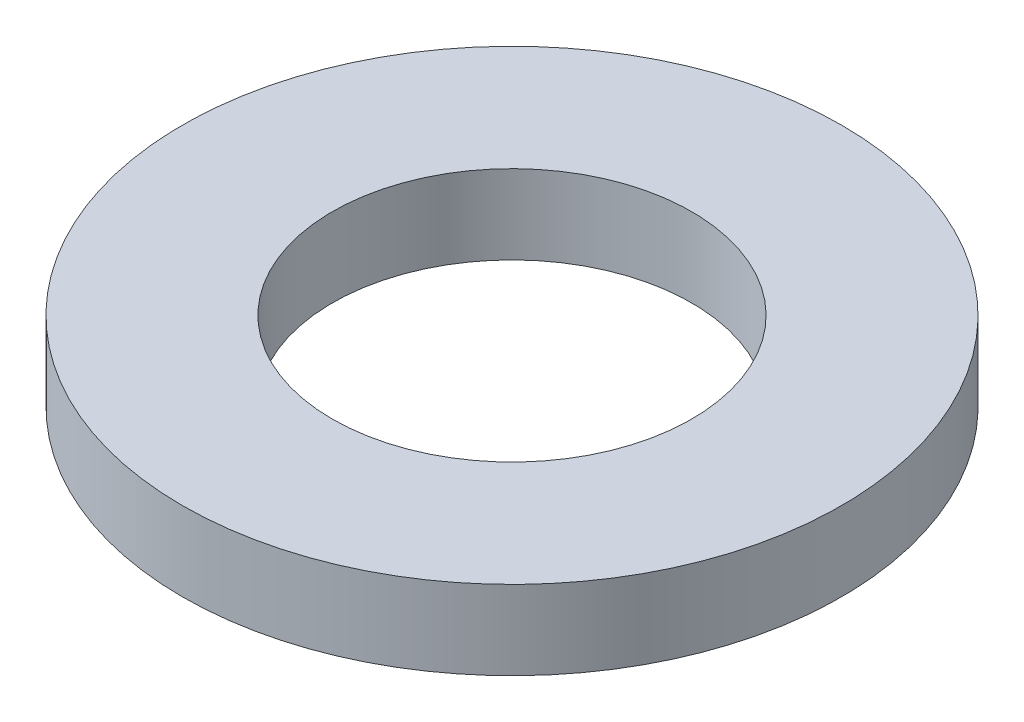
ISO-10303-21;
HEADER;
FILE_DESCRIPTION(('STEP AP214'),'2;1');
FILE_NAME('part.step','',(''),(''),'','','');
FILE_SCHEMA(('AUTOMOTIVE_DESIGN { 1 0 10303 214 1 1 1 1 }'));
ENDSEC;
DATA;
#1=APPLICATION_CONTEXT('core data for automotive mechanical design processes');
#2=APPLICATION_PROTOCOL_DEFINITION('international standard','automotive_design',2000,#1);
#3=PRODUCT_CONTEXT('',#1,'mechanical');
#4=PRODUCT('Part','Part','',(#3));
#5=PRODUCT_RELATED_PRODUCT_CATEGORY('part','',(#4));
#6=PRODUCT_DEFINITION_FORMATION('','',#4);
#7=PRODUCT_DEFINITION_CONTEXT('part definition',#1,'design');
#8=PRODUCT_DEFINITION('design','',#6,#7);
#9=PRODUCT_DEFINITION_SHAPE('','',#8);
#10=(LENGTH_UNIT() NAMED_UNIT(*) SI_UNIT(.MILLI.,.METRE.));
#11=(NAMED_UNIT(*) PLANE_ANGLE_UNIT() SI_UNIT($,.RADIAN.));
#12=(NAMED_UNIT(*) SI_UNIT($,.STERADIAN.) SOLID_ANGLE_UNIT());
#13=UNCERTAINTY_MEASURE_WITH_UNIT(LENGTH_MEASURE(1.E-05),#10,'distance_accuracy_value','');
#14=(GEOMETRIC_REPRESENTATION_CONTEXT(3) GLOBAL_UNCERTAINTY_ASSIGNED_CONTEXT((#13)) GLOBAL_UNIT_ASSIGNED_CONTEXT((#10,
#11,#12)) REPRESENTATION_CONTEXT('',''));
#15=CARTESIAN_POINT('',(0.,0.,0.));
#16=DIRECTION('',(0.,0.,1.));
#17=DIRECTION('',(1.,0.,0.));
#18=AXIS2_PLACEMENT_3D('',#15,#16,#17);
#19=CARTESIAN_POINT('',(0.,1.397,0.));
#20=DIRECTION('',(0.,1.,0.));
#21=DIRECTION('',(0.,0.,1.));
#22=AXIS2_PLACEMENT_3D('',#19,#20,#21);
#23=PLANE('',#22);
#24=CARTESIAN_POINT('',(0.,1.397,0.));
#25=DIRECTION('',(0.,1.,0.));
#26=DIRECTION('',(0.,0.,1.));
#27=AXIS2_PLACEMENT_3D('',#24,#25,#26);
#28=CIRCLE('',#27,11.6459);
#29=CARTESIAN_POINT('',(0.,1.397,11.6459));
#30=VERTEX_POINT('',#29);
#31=EDGE_CURVE('E10',#30,#30,#28,.T.);
#32=ORIENTED_EDGE('',*,*,#31,.T.);
#33=EDGE_LOOP('',(#32));
#34=FACE_BOUND('',#33,.T.);
#35=CARTESIAN_POINT('',(0.,1.397,0.));
#36=DIRECTION('',(0.,1.,0.));
#37=DIRECTION('',(0.,0.,1.));
#38=AXIS2_PLACEMENT_3D('',#35,#36,#37);
#39=CIRCLE('',#38,6.35);
#40=CARTESIAN_POINT('',(0.,1.397,6.35));
#41=VERTEX_POINT('',#40);
#42=EDGE_CURVE('E44',#41,#41,#39,.T.);
#43=ORIENTED_EDGE('',*,*,#42,.F.);
#44=EDGE_LOOP('',(#43));
#45=FACE_BOUND('',#44,.T.);
#46=ADVANCED_FACE('F33',(#34,#45),#23,.T.);
#47=CARTESIAN_POINT('',(0.,-1.397,0.));
#48=DIRECTION('',(0.,1.,0.));
#49=DIRECTION('',(0.,0.,1.));
#50=AXIS2_PLACEMENT_3D('',#47,#48,#49);
#51=PLANE('',#50);
#52=CARTESIAN_POINT('',(0.,-1.397,0.));
#53=DIRECTION('',(0.,1.,0.));
#54=DIRECTION('',(0.,0.,1.));
#55=AXIS2_PLACEMENT_3D('',#52,#53,#54);
#56=CIRCLE('',#55,11.6459);
#57=CARTESIAN_POINT('',(0.,-1.397,11.6459));
#58=VERTEX_POINT('',#57);
#59=EDGE_CURVE('E37',#58,#58,#56,.T.);
#60=ORIENTED_EDGE('',*,*,#59,.F.);
#61=EDGE_LOOP('',(#60));
#62=FACE_BOUND('',#61,.T.);
#63=CARTESIAN_POINT('',(0.,-1.397,0.));
#64=DIRECTION('',(0.,1.,0.));
#65=DIRECTION('',(0.,0.,1.));
#66=AXIS2_PLACEMENT_3D('',#63,#64,#65);
#67=CIRCLE('',#66,6.35);
#68=CARTESIAN_POINT('',(0.,-1.397,6.35));
#69=VERTEX_POINT('',#68);
#70=EDGE_CURVE('E46',#69,#69,#67,.T.);
#71=ORIENTED_EDGE('',*,*,#70,.T.);
#72=EDGE_LOOP('',(#71));
#73=FACE_BOUND('',#72,.T.);
#74=ADVANCED_FACE('F56',(#62,#73),#51,.F.);
#75=CARTESIAN_POINT('',(0.,1.397,0.));
#76=DIRECTION('',(0.,-1.,0.));
#77=DIRECTION('',(0.,0.,-1.));
#78=AXIS2_PLACEMENT_3D('',#75,#76,#77);
#79=CYLINDRICAL_SURFACE('',#78,11.6459);
#80=ORIENTED_EDGE('',*,*,#31,.F.);
#81=EDGE_LOOP('',(#80));
#82=FACE_BOUND('',#81,.T.);
#83=ORIENTED_EDGE('',*,*,#59,.T.);
#84=EDGE_LOOP('',(#83));
#85=FACE_BOUND('',#84,.T.);
#86=ADVANCED_FACE('F35',(#82,#85),#79,.T.);
#87=CARTESIAN_POINT('',(0.,1.397,0.));
#88=DIRECTION('',(0.,-1.,0.));
#89=DIRECTION('',(0.,0.,-1.));
#90=AXIS2_PLACEMENT_3D('',#87,#88,#89);
#91=CYLINDRICAL_SURFACE('',#90,6.35);
#92=ORIENTED_EDGE('',*,*,#42,.T.);
#93=EDGE_LOOP('',(#92));
#94=FACE_BOUND('',#93,.T.);
#95=ORIENTED_EDGE('',*,*,#70,.F.);
#96=EDGE_LOOP('',(#95));
#97=FACE_BOUND('',#96,.T.);
#98=ADVANCED_FACE('F52',(#94,#97),#91,.F.);
#99=CLOSED_SHELL('',(#46,#74,#86,#98));
#100=MANIFOLD_SOLID_BREP('B2',#99);
#101=ADVANCED_BREP_SHAPE_REPRESENTATION('',(#18,#100),#14);
#102=SHAPE_DEFINITION_REPRESENTATION(#9,#101);
ENDSEC;
END-ISO-10303-21;
